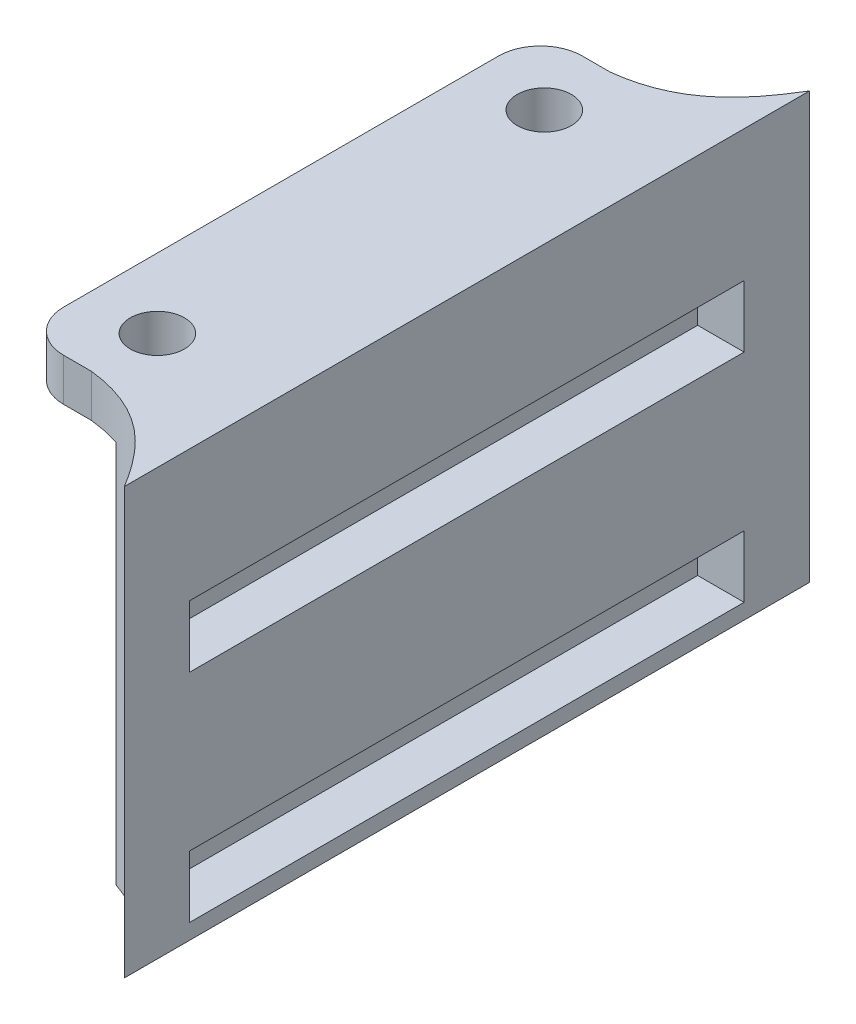
ISO-10303-21;
HEADER;
FILE_DESCRIPTION(('STEP AP214'),'2;1');
FILE_NAME('part.step','',(''),(''),'','','');
FILE_SCHEMA(('AUTOMOTIVE_DESIGN { 1 0 10303 214 1 1 1 1 }'));
ENDSEC;
DATA;
#1=APPLICATION_CONTEXT('core data for automotive mechanical design processes');
#2=APPLICATION_PROTOCOL_DEFINITION('international standard','automotive_design',2000,#1);
#3=PRODUCT_CONTEXT('',#1,'mechanical');
#4=PRODUCT('Part','Part','',(#3));
#5=PRODUCT_RELATED_PRODUCT_CATEGORY('part','',(#4));
#6=PRODUCT_DEFINITION_FORMATION('','',#4);
#7=PRODUCT_DEFINITION_CONTEXT('part definition',#1,'design');
#8=PRODUCT_DEFINITION('design','',#6,#7);
#9=PRODUCT_DEFINITION_SHAPE('','',#8);
#10=(LENGTH_UNIT() NAMED_UNIT(*) SI_UNIT(.MILLI.,.METRE.));
#11=(NAMED_UNIT(*) PLANE_ANGLE_UNIT() SI_UNIT($,.RADIAN.));
#12=(NAMED_UNIT(*) SI_UNIT($,.STERADIAN.) SOLID_ANGLE_UNIT());
#13=UNCERTAINTY_MEASURE_WITH_UNIT(LENGTH_MEASURE(1.E-05),#10,'distance_accuracy_value','');
#14=(GEOMETRIC_REPRESENTATION_CONTEXT(3) GLOBAL_UNCERTAINTY_ASSIGNED_CONTEXT((#13)) GLOBAL_UNIT_ASSIGNED_CONTEXT((#10,
#11,#12)) REPRESENTATION_CONTEXT('',''));
#15=CARTESIAN_POINT('',(0.,0.,0.));
#16=DIRECTION('',(0.,0.,1.));
#17=DIRECTION('',(1.,0.,0.));
#18=AXIS2_PLACEMENT_3D('',#15,#16,#17);
#19=CARTESIAN_POINT('',(-108.297393364929,-5.5,-30.1667131943031));
#20=DIRECTION('',(0.,1.,0.));
#21=DIRECTION('',(0.,0.,1.));
#22=AXIS2_PLACEMENT_3D('',#19,#20,#21);
#23=PLANE('',#22);
#24=CARTESIAN_POINT('',(-115.897393364929,-5.5,-23.6568720379147));
#25=DIRECTION('',(0.,1.,0.));
#26=DIRECTION('',(0.,0.,1.));
#27=AXIS2_PLACEMENT_3D('',#24,#25,#26);
#28=CIRCLE('',#27,5.4);
#29=CARTESIAN_POINT('',(-121.297393364929,-5.5,-23.6568720379147));
#30=VERTEX_POINT('',#29);
#31=CARTESIAN_POINT('',(-115.897393364929,-5.5,-29.0568720379147));
#32=VERTEX_POINT('',#31);
#33=EDGE_CURVE('E277',#30,#32,#28,.F.);
#34=ORIENTED_EDGE('',*,*,#33,.T.);
#35=DIRECTION('',(1.,0.,0.));
#36=VECTOR('',#35,1.);
#37=CARTESIAN_POINT('',(-115.797393364929,-5.5,-29.0568720379147));
#38=LINE('',#37,#36);
#39=CARTESIAN_POINT('',(-112.297393364929,-5.5,-29.0568720379147));
#40=VERTEX_POINT('',#39);
#41=EDGE_CURVE('E280',#32,#40,#38,.T.);
#42=ORIENTED_EDGE('',*,*,#41,.T.);
#43=CARTESIAN_POINT('',(-77.2973933649289,-5.5,-58.0568720379147));
#44=CARTESIAN_POINT('',(-97.4782956804952,-5.5,-56.5585431866768));
#45=CARTESIAN_POINT('',(-92.6699085338428,-5.5,-31.2993802591503));
#46=CARTESIAN_POINT('',(-112.297393364929,-5.5,-29.0568720379147));
#47=B_SPLINE_CURVE_WITH_KNOTS('',3,(#43,#44,#45,#46),.UNSPECIFIED.,.F.,.F.,(4,4),(0.,1.),.UNSPECIFIED.);
#48=CARTESIAN_POINT('',(-108.297393364929,-5.5,-29.9218737288001));
#49=VERTEX_POINT('',#48);
#50=EDGE_CURVE('E283',#40,#49,#47,.F.);
#51=ORIENTED_EDGE('',*,*,#50,.T.);
#52=DIRECTION('',(0.,0.,-1.));
#53=VECTOR('',#52,1.);
#54=CARTESIAN_POINT('',(-108.297393364929,-5.5,-30.1667131943031));
#55=LINE('',#54,#53);
#56=CARTESIAN_POINT('',(-108.297393364929,-5.5,38.8081296529707));
#57=VERTEX_POINT('',#56);
#58=EDGE_CURVE('E311',#57,#49,#55,.T.);
#59=ORIENTED_EDGE('',*,*,#58,.F.);
#60=CARTESIAN_POINT('',(-112.297393364929,-5.5,37.9431279620853));
#61=CARTESIAN_POINT('',(-92.6699085338428,-5.5,40.1856361833209));
#62=CARTESIAN_POINT('',(-97.4782956804952,-5.5,65.4447991108473));
#63=CARTESIAN_POINT('',(-77.2973933649289,-5.5,66.9431279620853));
#64=B_SPLINE_CURVE_WITH_KNOTS('',3,(#60,#61,#62,#63),.UNSPECIFIED.,.F.,.F.,(4,4),(0.,1.),.UNSPECIFIED.);
#65=CARTESIAN_POINT('',(-112.297393364929,-5.5,37.9431279620853));
#66=VERTEX_POINT('',#65);
#67=EDGE_CURVE('E294',#57,#66,#64,.F.);
#68=ORIENTED_EDGE('',*,*,#67,.T.);
#69=DIRECTION('',(-1.,0.,0.));
#70=VECTOR('',#69,1.);
#71=CARTESIAN_POINT('',(-115.797393364929,-5.5,37.9431279620853));
#72=LINE('',#71,#70);
#73=CARTESIAN_POINT('',(-115.897393364929,-5.5,37.9431279620853));
#74=VERTEX_POINT('',#73);
#75=EDGE_CURVE('E299',#66,#74,#72,.T.);
#76=ORIENTED_EDGE('',*,*,#75,.T.);
#77=CARTESIAN_POINT('',(-115.897393364929,-5.5,32.5431279620853));
#78=DIRECTION('',(0.,1.,0.));
#79=DIRECTION('',(0.,0.,1.));
#80=AXIS2_PLACEMENT_3D('',#77,#78,#79);
#81=CIRCLE('',#80,5.4);
#82=CARTESIAN_POINT('',(-121.297393364929,-5.5,32.5431279620853));
#83=VERTEX_POINT('',#82);
#84=EDGE_CURVE('E288',#74,#83,#81,.F.);
#85=ORIENTED_EDGE('',*,*,#84,.T.);
#86=DIRECTION('',(0.,0.,-1.));
#87=VECTOR('',#86,1.);
#88=CARTESIAN_POINT('',(-121.297393364929,-5.5,-30.1667131943031));
#89=LINE('',#88,#87);
#90=EDGE_CURVE('E239',#83,#30,#89,.T.);
#91=ORIENTED_EDGE('',*,*,#90,.T.);
#92=EDGE_LOOP('',(#34,#42,#51,#59,#68,#76,#85,#91));
#93=FACE_BOUND('',#92,.T.);
#94=CARTESIAN_POINT('',(-112.297393364929,-5.5,29.4431279620853));
#95=DIRECTION('',(0.,1.,0.));
#96=DIRECTION('',(0.,0.,1.));
#97=AXIS2_PLACEMENT_3D('',#94,#95,#96);
#98=CIRCLE('',#97,3.50000000000001);
#99=CARTESIAN_POINT('',(-112.297393364929,-5.5,32.9431279620853));
#100=VERTEX_POINT('',#99);
#101=EDGE_CURVE('E308',#100,#100,#98,.F.);
#102=ORIENTED_EDGE('',*,*,#101,.F.);
#103=EDGE_LOOP('',(#102));
#104=FACE_BOUND('',#103,.T.);
#105=CARTESIAN_POINT('',(-112.297393364929,-5.5,-20.5568720379147));
#106=DIRECTION('',(0.,1.,0.));
#107=DIRECTION('',(0.,0.,1.));
#108=AXIS2_PLACEMENT_3D('',#105,#106,#107);
#109=CIRCLE('',#108,3.50000000000001);
#110=CARTESIAN_POINT('',(-112.297393364929,-5.5,-17.0568720379147));
#111=VERTEX_POINT('',#110);
#112=EDGE_CURVE('E305',#111,#111,#109,.F.);
#113=ORIENTED_EDGE('',*,*,#112,.F.);
#114=EDGE_LOOP('',(#113));
#115=FACE_BOUND('',#114,.T.);
#116=ADVANCED_FACE('F35',(#93,#104,#115),#23,.F.);
#117=CARTESIAN_POINT('',(-108.297393364929,0.,0.));
#118=DIRECTION('',(-1.,0.,0.));
#119=DIRECTION('',(0.,0.,1.));
#120=AXIS2_PLACEMENT_3D('',#117,#118,#119);
#121=PLANE('',#120);
#122=DIRECTION('',(0.,0.,-1.));
#123=VECTOR('',#122,1.);
#124=CARTESIAN_POINT('',(-108.297393364929,-55.,32.5431279620853));
#125=LINE('',#124,#123);
#126=CARTESIAN_POINT('',(-108.297393364929,-55.,38.8081296548846));
#127=VERTEX_POINT('',#126);
#128=CARTESIAN_POINT('',(-108.297393359178,-55.,-29.921873730714));
#129=VERTEX_POINT('',#128);
#130=EDGE_CURVE('E419',#127,#129,#125,.T.);
#131=ORIENTED_EDGE('',*,*,#130,.F.);
#132=DIRECTION('',(0.,1.,0.));
#133=VECTOR('',#132,1.);
#134=CARTESIAN_POINT('',(-108.297393364929,-55.,38.8081296529707));
#135=LINE('',#134,#133);
#136=EDGE_CURVE('E252',#57,#127,#135,.F.);
#137=ORIENTED_EDGE('',*,*,#136,.F.);
#138=ORIENTED_EDGE('',*,*,#58,.T.);
#139=DIRECTION('',(0.,1.,0.));
#140=VECTOR('',#139,1.);
#141=CARTESIAN_POINT('',(-108.297393364929,-55.,-29.9218737288001));
#142=LINE('',#141,#140);
#143=EDGE_CURVE('E273',#129,#49,#142,.T.);
#144=ORIENTED_EDGE('',*,*,#143,.F.);
#145=EDGE_LOOP('',(#131,#137,#138,#144));
#146=FACE_BOUND('',#145,.T.);
#147=ADVANCED_FACE('F167',(#146),#121,.T.);
#148=CARTESIAN_POINT('',(-112.297393364929,-55.,-20.5568720379147));
#149=DIRECTION('',(0.,1.,0.));
#150=DIRECTION('',(0.,0.,1.));
#151=AXIS2_PLACEMENT_3D('',#148,#149,#150);
#152=CYLINDRICAL_SURFACE('',#151,3.50000000000001);
#153=ORIENTED_EDGE('',*,*,#112,.T.);
#154=EDGE_LOOP('',(#153));
#155=FACE_BOUND('',#154,.T.);
#156=CARTESIAN_POINT('',(-112.297393364929,0.,-20.5568720379147));
#157=DIRECTION('',(0.,1.,0.));
#158=DIRECTION('',(0.,0.,1.));
#159=AXIS2_PLACEMENT_3D('',#156,#157,#158);
#160=CIRCLE('',#159,3.50000000000001);
#161=CARTESIAN_POINT('',(-112.297393364929,0.,-17.0568720379147));
#162=VERTEX_POINT('',#161);
#163=EDGE_CURVE('E264',#162,#162,#160,.T.);
#164=ORIENTED_EDGE('',*,*,#163,.T.);
#165=EDGE_LOOP('',(#164));
#166=FACE_BOUND('',#165,.T.);
#167=ADVANCED_FACE('F163',(#155,#166),#152,.F.);
#168=CARTESIAN_POINT('',(-112.297393364929,-55.,29.4431279620853));
#169=DIRECTION('',(0.,1.,0.));
#170=DIRECTION('',(0.,0.,1.));
#171=AXIS2_PLACEMENT_3D('',#168,#169,#170);
#172=CYLINDRICAL_SURFACE('',#171,3.50000000000001);
#173=ORIENTED_EDGE('',*,*,#101,.T.);
#174=EDGE_LOOP('',(#173));
#175=FACE_BOUND('',#174,.T.);
#176=CARTESIAN_POINT('',(-112.297393364929,0.,29.4431279620853));
#177=DIRECTION('',(0.,1.,0.));
#178=DIRECTION('',(0.,0.,1.));
#179=AXIS2_PLACEMENT_3D('',#176,#177,#178);
#180=CIRCLE('',#179,3.50000000000001);
#181=CARTESIAN_POINT('',(-112.297393364929,0.,32.9431279620853));
#182=VERTEX_POINT('',#181);
#183=EDGE_CURVE('E270',#182,#182,#180,.T.);
#184=ORIENTED_EDGE('',*,*,#183,.T.);
#185=EDGE_LOOP('',(#184));
#186=FACE_BOUND('',#185,.T.);
#187=ADVANCED_FACE('F166',(#175,#186),#172,.F.);
#188=CARTESIAN_POINT('',(-115.797393364929,-55.,37.9431279620853));
#189=DIRECTION('',(0.,0.,1.));
#190=DIRECTION('',(1.,0.,0.));
#191=AXIS2_PLACEMENT_3D('',#188,#189,#190);
#192=PLANE('',#191);
#193=ORIENTED_EDGE('',*,*,#75,.F.);
#194=DIRECTION('',(0.,1.,0.));
#195=VECTOR('',#194,1.);
#196=CARTESIAN_POINT('',(-112.297393364929,-55.,37.9431279620853));
#197=LINE('',#196,#195);
#198=CARTESIAN_POINT('',(-112.297393364929,0.,37.9431279620853));
#199=VERTEX_POINT('',#198);
#200=EDGE_CURVE('E450',#66,#199,#197,.T.);
#201=ORIENTED_EDGE('',*,*,#200,.T.);
#202=DIRECTION('',(1.,0.,0.));
#203=VECTOR('',#202,1.);
#204=CARTESIAN_POINT('',(-115.797393364929,0.,37.9431279620853));
#205=LINE('',#204,#203);
#206=CARTESIAN_POINT('',(-115.897393364929,0.,37.9431279620853));
#207=VERTEX_POINT('',#206);
#208=EDGE_CURVE('E434',#207,#199,#205,.T.);
#209=ORIENTED_EDGE('',*,*,#208,.F.);
#210=DIRECTION('',(0.,1.,0.));
#211=VECTOR('',#210,1.);
#212=CARTESIAN_POINT('',(-115.897393364929,-55.,37.9431279620853));
#213=LINE('',#212,#211);
#214=EDGE_CURVE('E134',#74,#207,#213,.T.);
#215=ORIENTED_EDGE('',*,*,#214,.F.);
#216=EDGE_LOOP('',(#193,#201,#209,#215));
#217=FACE_BOUND('',#216,.T.);
#218=ADVANCED_FACE('F171',(#217),#192,.T.);
#219=CARTESIAN_POINT('',(-115.897393364929,-55.,32.5431279620853));
#220=DIRECTION('',(0.,1.,0.));
#221=DIRECTION('',(0.,0.,1.));
#222=AXIS2_PLACEMENT_3D('',#219,#220,#221);
#223=CYLINDRICAL_SURFACE('',#222,5.4);
#224=ORIENTED_EDGE('',*,*,#84,.F.);
#225=ORIENTED_EDGE('',*,*,#214,.T.);
#226=CARTESIAN_POINT('',(-115.897393364929,0.,32.5431279620853));
#227=DIRECTION('',(0.,1.,0.));
#228=DIRECTION('',(0.,0.,-1.));
#229=AXIS2_PLACEMENT_3D('',#226,#227,#228);
#230=CIRCLE('',#229,5.4);
#231=CARTESIAN_POINT('',(-121.297393364929,0.,32.5431279620853));
#232=VERTEX_POINT('',#231);
#233=EDGE_CURVE('E262',#232,#207,#230,.T.);
#234=ORIENTED_EDGE('',*,*,#233,.F.);
#235=DIRECTION('',(0.,1.,0.));
#236=VECTOR('',#235,1.);
#237=CARTESIAN_POINT('',(-121.297393364929,-55.,32.5431279620853));
#238=LINE('',#237,#236);
#239=EDGE_CURVE('E415',#83,#232,#238,.T.);
#240=ORIENTED_EDGE('',*,*,#239,.F.);
#241=EDGE_LOOP('',(#224,#225,#234,#240));
#242=FACE_BOUND('',#241,.T.);
#243=ADVANCED_FACE('F161',(#242),#223,.T.);
#244=CARTESIAN_POINT('',(-121.297393364929,-55.,-23.6568720379147));
#245=DIRECTION('',(-1.,0.,0.));
#246=DIRECTION('',(0.,0.,1.));
#247=AXIS2_PLACEMENT_3D('',#244,#245,#246);
#248=PLANE('',#247);
#249=ORIENTED_EDGE('',*,*,#90,.F.);
#250=ORIENTED_EDGE('',*,*,#239,.T.);
#251=DIRECTION('',(0.,0.,1.));
#252=VECTOR('',#251,1.);
#253=CARTESIAN_POINT('',(-121.297393364929,0.,-23.6568720379147));
#254=LINE('',#253,#252);
#255=CARTESIAN_POINT('',(-121.297393364929,0.,-23.6568720379147));
#256=VERTEX_POINT('',#255);
#257=EDGE_CURVE('E253',#256,#232,#254,.T.);
#258=ORIENTED_EDGE('',*,*,#257,.F.);
#259=DIRECTION('',(0.,1.,0.));
#260=VECTOR('',#259,1.);
#261=CARTESIAN_POINT('',(-121.297393364929,-55.,-23.6568720379147));
#262=LINE('',#261,#260);
#263=EDGE_CURVE('E417',#30,#256,#262,.T.);
#264=ORIENTED_EDGE('',*,*,#263,.F.);
#265=EDGE_LOOP('',(#249,#250,#258,#264));
#266=FACE_BOUND('',#265,.T.);
#267=ADVANCED_FACE('F157',(#266),#248,.T.);
#268=CARTESIAN_POINT('',(-115.897393364929,-55.,-23.6568720379147));
#269=DIRECTION('',(0.,1.,0.));
#270=DIRECTION('',(0.,0.,1.));
#271=AXIS2_PLACEMENT_3D('',#268,#269,#270);
#272=CYLINDRICAL_SURFACE('',#271,5.4);
#273=ORIENTED_EDGE('',*,*,#33,.F.);
#274=ORIENTED_EDGE('',*,*,#263,.T.);
#275=CARTESIAN_POINT('',(-115.897393364929,0.,-23.6568720379147));
#276=DIRECTION('',(0.,1.,0.));
#277=DIRECTION('',(0.,0.,1.));
#278=AXIS2_PLACEMENT_3D('',#275,#276,#277);
#279=CIRCLE('',#278,5.4);
#280=CARTESIAN_POINT('',(-115.897393364929,0.,-29.0568720379147));
#281=VERTEX_POINT('',#280);
#282=EDGE_CURVE('E255',#281,#256,#279,.T.);
#283=ORIENTED_EDGE('',*,*,#282,.F.);
#284=DIRECTION('',(0.,1.,0.));
#285=VECTOR('',#284,1.);
#286=CARTESIAN_POINT('',(-115.897393364929,-55.,-29.0568720379147));
#287=LINE('',#286,#285);
#288=EDGE_CURVE('E421',#32,#281,#287,.T.);
#289=ORIENTED_EDGE('',*,*,#288,.F.);
#290=EDGE_LOOP('',(#273,#274,#283,#289));
#291=FACE_BOUND('',#290,.T.);
#292=ADVANCED_FACE('F153',(#291),#272,.T.);
#293=CARTESIAN_POINT('',(-115.797393364929,-55.,-29.0568720379147));
#294=DIRECTION('',(0.,0.,-1.));
#295=DIRECTION('',(-1.,0.,0.));
#296=AXIS2_PLACEMENT_3D('',#293,#294,#295);
#297=PLANE('',#296);
#298=ORIENTED_EDGE('',*,*,#41,.F.);
#299=ORIENTED_EDGE('',*,*,#288,.T.);
#300=DIRECTION('',(-1.,0.,0.));
#301=VECTOR('',#300,1.);
#302=CARTESIAN_POINT('',(-115.797393364929,0.,-29.0568720379147));
#303=LINE('',#302,#301);
#304=CARTESIAN_POINT('',(-112.297393364929,0.,-29.0568720379147));
#305=VERTEX_POINT('',#304);
#306=EDGE_CURVE('E428',#305,#281,#303,.T.);
#307=ORIENTED_EDGE('',*,*,#306,.F.);
#308=DIRECTION('',(0.,1.,0.));
#309=VECTOR('',#308,1.);
#310=CARTESIAN_POINT('',(-112.297393364929,-55.,-29.0568720379147));
#311=LINE('',#310,#309);
#312=EDGE_CURVE('E448',#40,#305,#311,.T.);
#313=ORIENTED_EDGE('',*,*,#312,.F.);
#314=EDGE_LOOP('',(#298,#299,#307,#313));
#315=FACE_BOUND('',#314,.T.);
#316=ADVANCED_FACE('F147',(#315),#297,.T.);
#317=CARTESIAN_POINT('',(-77.2973933649289,-55.,-58.0568720379147));
#318=CARTESIAN_POINT('',(-97.4782956804952,-55.,-56.5585431866768));
#319=CARTESIAN_POINT('',(-92.6699085338428,-55.,-31.2993802591503));
#320=CARTESIAN_POINT('',(-112.297393364929,-55.,-29.0568720379147));
#321=B_SPLINE_CURVE_WITH_KNOTS('',3,(#317,#318,#319,#320),.UNSPECIFIED.,.F.,.F.,(4,4),(0.,1.),.UNSPECIFIED.);
#322=DIRECTION('',(0.,1.,0.));
#323=VECTOR('',#322,1.);
#324=SURFACE_OF_LINEAR_EXTRUSION('',#321,#323);
#325=DIRECTION('',(0.,1.,0.));
#326=VECTOR('',#325,1.);
#327=CARTESIAN_POINT('',(-97.2973933577945,-55.,-39.823610008286));
#328=LINE('',#327,#326);
#329=CARTESIAN_POINT('',(-97.2973933577945,-55.,-39.823610008286));
#330=VERTEX_POINT('',#329);
#331=CARTESIAN_POINT('',(-97.2973933480429,0.,-39.8236100243836));
#332=VERTEX_POINT('',#331);
#333=EDGE_CURVE('E248',#330,#332,#328,.T.);
#334=ORIENTED_EDGE('',*,*,#333,.F.);
#335=EDGE_CURVE('E127',#330,#129,#321,.T.);
#336=ORIENTED_EDGE('',*,*,#335,.T.);
#337=ORIENTED_EDGE('',*,*,#143,.T.);
#338=ORIENTED_EDGE('',*,*,#50,.F.);
#339=ORIENTED_EDGE('',*,*,#312,.T.);
#340=CARTESIAN_POINT('',(-77.2973933649289,0.,-58.0568720379147));
#341=CARTESIAN_POINT('',(-97.4782956804952,0.,-56.5585431866768));
#342=CARTESIAN_POINT('',(-92.6699085338428,0.,-31.2993802591503));
#343=CARTESIAN_POINT('',(-112.297393364929,0.,-29.0568720379147));
#344=B_SPLINE_CURVE_WITH_KNOTS('',3,(#340,#341,#342,#343),.UNSPECIFIED.,.F.,.F.,(4,4),(0.,1.),.UNSPECIFIED.);
#345=EDGE_CURVE('E135',#332,#305,#344,.T.);
#346=ORIENTED_EDGE('',*,*,#345,.F.);
#347=EDGE_LOOP('',(#334,#336,#337,#338,#339,#346));
#348=FACE_BOUND('',#347,.T.);
#349=ADVANCED_FACE('F142',(#348),#324,.T.);
#350=CARTESIAN_POINT('',(-112.297393364929,-55.,37.9431279620853));
#351=CARTESIAN_POINT('',(-92.6699085338428,-55.,40.1856361833209));
#352=CARTESIAN_POINT('',(-97.4782956804952,-55.,65.4447991108473));
#353=CARTESIAN_POINT('',(-77.2973933649289,-55.,66.9431279620853));
#354=B_SPLINE_CURVE_WITH_KNOTS('',3,(#350,#351,#352,#353),.UNSPECIFIED.,.F.,.F.,(4,4),(0.,1.),.UNSPECIFIED.);
#355=DIRECTION('',(0.,1.,0.));
#356=VECTOR('',#355,1.);
#357=SURFACE_OF_LINEAR_EXTRUSION('',#354,#356);
#358=DIRECTION('',(0.,1.,0.));
#359=VECTOR('',#358,1.);
#360=CARTESIAN_POINT('',(-97.2973933577952,-55.,48.7098659324555));
#361=LINE('',#360,#359);
#362=CARTESIAN_POINT('',(-97.2973933480436,0.,48.7098659485531));
#363=VERTEX_POINT('',#362);
#364=CARTESIAN_POINT('',(-97.2973933577952,-55.,48.7098659324555));
#365=VERTEX_POINT('',#364);
#366=EDGE_CURVE('E39',#363,#365,#361,.F.);
#367=ORIENTED_EDGE('',*,*,#366,.F.);
#368=CARTESIAN_POINT('',(-112.297393364929,0.,37.9431279620853));
#369=CARTESIAN_POINT('',(-92.6699085338428,0.,40.1856361833209));
#370=CARTESIAN_POINT('',(-97.4782956804952,0.,65.4447991108473));
#371=CARTESIAN_POINT('',(-77.2973933649289,0.,66.9431279620853));
#372=B_SPLINE_CURVE_WITH_KNOTS('',3,(#368,#369,#370,#371),.UNSPECIFIED.,.F.,.F.,(4,4),(0.,1.),.UNSPECIFIED.);
#373=EDGE_CURVE('E431',#199,#363,#372,.T.);
#374=ORIENTED_EDGE('',*,*,#373,.F.);
#375=ORIENTED_EDGE('',*,*,#200,.F.);
#376=ORIENTED_EDGE('',*,*,#67,.F.);
#377=ORIENTED_EDGE('',*,*,#136,.T.);
#378=EDGE_CURVE('E133',#127,#365,#354,.T.);
#379=ORIENTED_EDGE('',*,*,#378,.T.);
#380=EDGE_LOOP('',(#367,#374,#375,#376,#377,#379));
#381=FACE_BOUND('',#380,.T.);
#382=ADVANCED_FACE('F146',(#381),#357,.T.);
#383=CARTESIAN_POINT('',(-115.897393364929,0.,32.5431279620853));
#384=DIRECTION('',(0.,-1.,0.));
#385=DIRECTION('',(0.,0.,-1.));
#386=AXIS2_PLACEMENT_3D('',#383,#384,#385);
#387=PLANE('',#386);
#388=ORIENTED_EDGE('',*,*,#373,.T.);
#389=DIRECTION('',(0.,0.,1.));
#390=VECTOR('',#389,1.);
#391=CARTESIAN_POINT('',(-97.2973933649289,0.,-31.3723575276166));
#392=LINE('',#391,#390);
#393=EDGE_CURVE('E238',#332,#363,#392,.T.);
#394=ORIENTED_EDGE('',*,*,#393,.F.);
#395=ORIENTED_EDGE('',*,*,#345,.T.);
#396=ORIENTED_EDGE('',*,*,#306,.T.);
#397=ORIENTED_EDGE('',*,*,#282,.T.);
#398=ORIENTED_EDGE('',*,*,#257,.T.);
#399=ORIENTED_EDGE('',*,*,#233,.T.);
#400=ORIENTED_EDGE('',*,*,#208,.T.);
#401=EDGE_LOOP('',(#388,#394,#395,#396,#397,#398,#399,#400));
#402=FACE_BOUND('',#401,.T.);
#403=ORIENTED_EDGE('',*,*,#183,.F.);
#404=EDGE_LOOP('',(#403));
#405=FACE_BOUND('',#404,.T.);
#406=ORIENTED_EDGE('',*,*,#163,.F.);
#407=EDGE_LOOP('',(#406));
#408=FACE_BOUND('',#407,.T.);
#409=ADVANCED_FACE('F37',(#402,#405,#408),#387,.F.);
#410=CARTESIAN_POINT('',(-115.897393364929,-55.,32.5431279620853));
#411=DIRECTION('',(0.,-1.,0.));
#412=DIRECTION('',(0.,0.,-1.));
#413=AXIS2_PLACEMENT_3D('',#410,#411,#412);
#414=PLANE('',#413);
#415=DIRECTION('',(0.,0.,1.));
#416=VECTOR('',#415,1.);
#417=CARTESIAN_POINT('',(-97.2973933649289,-55.,-31.3723575276166));
#418=LINE('',#417,#416);
#419=EDGE_CURVE('E228',#330,#365,#418,.T.);
#420=ORIENTED_EDGE('',*,*,#419,.T.);
#421=ORIENTED_EDGE('',*,*,#378,.F.);
#422=ORIENTED_EDGE('',*,*,#130,.T.);
#423=ORIENTED_EDGE('',*,*,#335,.F.);
#424=EDGE_LOOP('',(#420,#421,#422,#423));
#425=FACE_BOUND('',#424,.T.);
#426=ADVANCED_FACE('F198',(#425),#414,.T.);
#427=CARTESIAN_POINT('',(-97.2973933577945,-55.02,-39.823610008286));
#428=DIRECTION('',(-1.,0.,0.));
#429=DIRECTION('',(0.,0.,1.));
#430=AXIS2_PLACEMENT_3D('',#427,#428,#429);
#431=PLANE('',#430);
#432=DIRECTION('',(0.,1.,0.));
#433=VECTOR('',#432,1.);
#434=CARTESIAN_POINT('',(-97.2973933649289,-45.,-31.3723575276166));
#435=LINE('',#434,#433);
#436=CARTESIAN_POINT('',(-97.2973933649289,-53.,-31.3723575276166));
#437=VERTEX_POINT('',#436);
#438=CARTESIAN_POINT('',(-97.2973933649289,-45.,-31.3723575276166));
#439=VERTEX_POINT('',#438);
#440=EDGE_CURVE('E123',#437,#439,#435,.T.);
#441=ORIENTED_EDGE('',*,*,#440,.F.);
#442=DIRECTION('',(0.,0.,-1.));
#443=VECTOR('',#442,1.);
#444=CARTESIAN_POINT('',(-97.2973933649289,-53.,40.2586431743358));
#445=LINE('',#444,#443);
#446=CARTESIAN_POINT('',(-97.2973933649289,-53.,40.2586431743358));
#447=VERTEX_POINT('',#446);
#448=EDGE_CURVE('E355',#447,#437,#445,.T.);
#449=ORIENTED_EDGE('',*,*,#448,.F.);
#450=DIRECTION('',(0.,-1.,0.));
#451=VECTOR('',#450,1.);
#452=CARTESIAN_POINT('',(-97.2973933649289,-45.,40.2586431743358));
#453=LINE('',#452,#451);
#454=CARTESIAN_POINT('',(-97.2973933649289,-45.,40.2586431743358));
#455=VERTEX_POINT('',#454);
#456=EDGE_CURVE('E107',#455,#447,#453,.T.);
#457=ORIENTED_EDGE('',*,*,#456,.F.);
#458=DIRECTION('',(0.,0.,1.));
#459=VECTOR('',#458,1.);
#460=CARTESIAN_POINT('',(-97.2973933649289,-45.,40.2586431743358));
#461=LINE('',#460,#459);
#462=EDGE_CURVE('E120',#439,#455,#461,.T.);
#463=ORIENTED_EDGE('',*,*,#462,.F.);
#464=EDGE_LOOP('',(#441,#449,#457,#463));
#465=FACE_BOUND('',#464,.T.);
#466=DIRECTION('',(0.,1.,0.));
#467=VECTOR('',#466,1.);
#468=CARTESIAN_POINT('',(-97.2973933649289,-25.,-31.3723575276166));
#469=LINE('',#468,#467);
#470=CARTESIAN_POINT('',(-97.2973933649289,-25.,-31.3723575276166));
#471=VERTEX_POINT('',#470);
#472=CARTESIAN_POINT('',(-97.2973933649289,-17.,-31.3723575276166));
#473=VERTEX_POINT('',#472);
#474=EDGE_CURVE('E54',#471,#473,#469,.T.);
#475=ORIENTED_EDGE('',*,*,#474,.F.);
#476=DIRECTION('',(0.,0.,-1.));
#477=VECTOR('',#476,1.);
#478=CARTESIAN_POINT('',(-97.2973933649289,-25.,40.2586431743358));
#479=LINE('',#478,#477);
#480=CARTESIAN_POINT('',(-97.2973933649289,-25.,40.2586431743358));
#481=VERTEX_POINT('',#480);
#482=EDGE_CURVE('E45',#481,#471,#479,.T.);
#483=ORIENTED_EDGE('',*,*,#482,.F.);
#484=DIRECTION('',(0.,-1.,0.));
#485=VECTOR('',#484,1.);
#486=CARTESIAN_POINT('',(-97.2973933649289,-17.,40.2586431743358));
#487=LINE('',#486,#485);
#488=CARTESIAN_POINT('',(-97.2973933649289,-17.,40.2586431743358));
#489=VERTEX_POINT('',#488);
#490=EDGE_CURVE('E11',#489,#481,#487,.T.);
#491=ORIENTED_EDGE('',*,*,#490,.F.);
#492=DIRECTION('',(0.,0.,1.));
#493=VECTOR('',#492,1.);
#494=CARTESIAN_POINT('',(-97.2973933649289,-17.,40.2586431743358));
#495=LINE('',#494,#493);
#496=EDGE_CURVE('E332',#473,#489,#495,.T.);
#497=ORIENTED_EDGE('',*,*,#496,.F.);
#498=EDGE_LOOP('',(#475,#483,#491,#497));
#499=FACE_BOUND('',#498,.T.);
#500=ORIENTED_EDGE('',*,*,#419,.F.);
#501=ORIENTED_EDGE('',*,*,#333,.T.);
#502=ORIENTED_EDGE('',*,*,#393,.T.);
#503=ORIENTED_EDGE('',*,*,#366,.T.);
#504=EDGE_LOOP('',(#500,#501,#502,#503));
#505=FACE_BOUND('',#504,.T.);
#506=ADVANCED_FACE('F176',(#465,#499,#505),#431,.F.);
#507=CARTESIAN_POINT('',(-103.297393364929,-17.,40.2586431743358));
#508=DIRECTION('',(0.,1.,0.));
#509=DIRECTION('',(0.,0.,1.));
#510=AXIS2_PLACEMENT_3D('',#507,#508,#509);
#511=PLANE('',#510);
#512=ORIENTED_EDGE('',*,*,#496,.T.);
#513=DIRECTION('',(1.,0.,0.));
#514=VECTOR('',#513,1.);
#515=CARTESIAN_POINT('',(-103.297393364929,-17.,40.2586431743358));
#516=LINE('',#515,#514);
#517=CARTESIAN_POINT('',(-103.297393364929,-17.,40.2586431743358));
#518=VERTEX_POINT('',#517);
#519=EDGE_CURVE('E329',#518,#489,#516,.T.);
#520=ORIENTED_EDGE('',*,*,#519,.F.);
#521=DIRECTION('',(0.,0.,1.));
#522=VECTOR('',#521,1.);
#523=CARTESIAN_POINT('',(-103.297393364929,-17.,40.2586431743358));
#524=LINE('',#523,#522);
#525=CARTESIAN_POINT('',(-103.297393364929,-17.,-31.3723575276166));
#526=VERTEX_POINT('',#525);
#527=EDGE_CURVE('E323',#526,#518,#524,.T.);
#528=ORIENTED_EDGE('',*,*,#527,.F.);
#529=DIRECTION('',(1.,0.,0.));
#530=VECTOR('',#529,1.);
#531=CARTESIAN_POINT('',(-103.297393364929,-17.,-31.3723575276166));
#532=LINE('',#531,#530);
#533=EDGE_CURVE('E326',#526,#473,#532,.T.);
#534=ORIENTED_EDGE('',*,*,#533,.T.);
#535=EDGE_LOOP('',(#512,#520,#528,#534));
#536=FACE_BOUND('',#535,.T.);
#537=ADVANCED_FACE('F184',(#536),#511,.F.);
#538=CARTESIAN_POINT('',(-103.297393364929,-17.,40.2586431743358));
#539=DIRECTION('',(0.,0.,1.));
#540=DIRECTION('',(1.,0.,0.));
#541=AXIS2_PLACEMENT_3D('',#538,#539,#540);
#542=PLANE('',#541);
#543=ORIENTED_EDGE('',*,*,#490,.T.);
#544=DIRECTION('',(1.,0.,0.));
#545=VECTOR('',#544,1.);
#546=CARTESIAN_POINT('',(-103.297393364929,-25.,40.2586431743358));
#547=LINE('',#546,#545);
#548=CARTESIAN_POINT('',(-103.297393364929,-25.,40.2586431743358));
#549=VERTEX_POINT('',#548);
#550=EDGE_CURVE('E320',#549,#481,#547,.T.);
#551=ORIENTED_EDGE('',*,*,#550,.F.);
#552=DIRECTION('',(0.,-1.,0.));
#553=VECTOR('',#552,1.);
#554=CARTESIAN_POINT('',(-103.297393364929,-17.,40.2586431743358));
#555=LINE('',#554,#553);
#556=EDGE_CURVE('E335',#518,#549,#555,.T.);
#557=ORIENTED_EDGE('',*,*,#556,.F.);
#558=ORIENTED_EDGE('',*,*,#519,.T.);
#559=EDGE_LOOP('',(#543,#551,#557,#558));
#560=FACE_BOUND('',#559,.T.);
#561=ADVANCED_FACE('F180',(#560),#542,.F.);
#562=CARTESIAN_POINT('',(-103.297393364929,0.,0.));
#563=DIRECTION('',(1.,0.,0.));
#564=DIRECTION('',(0.,0.,-1.));
#565=AXIS2_PLACEMENT_3D('',#562,#563,#564);
#566=PLANE('',#565);
#567=ORIENTED_EDGE('',*,*,#556,.T.);
#568=DIRECTION('',(0.,0.,-1.));
#569=VECTOR('',#568,1.);
#570=CARTESIAN_POINT('',(-103.297393364929,-25.,40.2586431743358));
#571=LINE('',#570,#569);
#572=CARTESIAN_POINT('',(-103.297393364929,-25.,-31.3723575276166));
#573=VERTEX_POINT('',#572);
#574=EDGE_CURVE('E344',#549,#573,#571,.T.);
#575=ORIENTED_EDGE('',*,*,#574,.T.);
#576=DIRECTION('',(0.,1.,0.));
#577=VECTOR('',#576,1.);
#578=CARTESIAN_POINT('',(-103.297393364929,-25.,-31.3723575276166));
#579=LINE('',#578,#577);
#580=EDGE_CURVE('E341',#573,#526,#579,.T.);
#581=ORIENTED_EDGE('',*,*,#580,.T.);
#582=ORIENTED_EDGE('',*,*,#527,.T.);
#583=EDGE_LOOP('',(#567,#575,#581,#582));
#584=FACE_BOUND('',#583,.T.);
#585=ADVANCED_FACE('F183',(#584),#566,.T.);
#586=CARTESIAN_POINT('',(-103.297393364929,-25.,-31.3723575276166));
#587=DIRECTION('',(0.,0.,-1.));
#588=DIRECTION('',(-1.,0.,0.));
#589=AXIS2_PLACEMENT_3D('',#586,#587,#588);
#590=PLANE('',#589);
#591=ORIENTED_EDGE('',*,*,#474,.T.);
#592=ORIENTED_EDGE('',*,*,#533,.F.);
#593=ORIENTED_EDGE('',*,*,#580,.F.);
#594=DIRECTION('',(1.,0.,0.));
#595=VECTOR('',#594,1.);
#596=CARTESIAN_POINT('',(-103.297393364929,-25.,-31.3723575276166));
#597=LINE('',#596,#595);
#598=EDGE_CURVE('E324',#573,#471,#597,.T.);
#599=ORIENTED_EDGE('',*,*,#598,.T.);
#600=EDGE_LOOP('',(#591,#592,#593,#599));
#601=FACE_BOUND('',#600,.T.);
#602=ADVANCED_FACE('F190',(#601),#590,.F.);
#603=CARTESIAN_POINT('',(-103.297393364929,-25.,40.2586431743358));
#604=DIRECTION('',(0.,-1.,0.));
#605=DIRECTION('',(0.,0.,-1.));
#606=AXIS2_PLACEMENT_3D('',#603,#604,#605);
#607=PLANE('',#606);
#608=ORIENTED_EDGE('',*,*,#482,.T.);
#609=ORIENTED_EDGE('',*,*,#598,.F.);
#610=ORIENTED_EDGE('',*,*,#574,.F.);
#611=ORIENTED_EDGE('',*,*,#550,.T.);
#612=EDGE_LOOP('',(#608,#609,#610,#611));
#613=FACE_BOUND('',#612,.T.);
#614=ADVANCED_FACE('F186',(#613),#607,.F.);
#615=CARTESIAN_POINT('',(-103.297393364929,-45.,40.2586431743358));
#616=DIRECTION('',(0.,1.,0.));
#617=DIRECTION('',(0.,0.,1.));
#618=AXIS2_PLACEMENT_3D('',#615,#616,#617);
#619=PLANE('',#618);
#620=ORIENTED_EDGE('',*,*,#462,.T.);
#621=DIRECTION('',(1.,0.,0.));
#622=VECTOR('',#621,1.);
#623=CARTESIAN_POINT('',(-103.297393364929,-45.,40.2586431743358));
#624=LINE('',#623,#622);
#625=CARTESIAN_POINT('',(-103.297393364929,-45.,40.2586431743358));
#626=VERTEX_POINT('',#625);
#627=EDGE_CURVE('E317',#626,#455,#624,.T.);
#628=ORIENTED_EDGE('',*,*,#627,.F.);
#629=DIRECTION('',(0.,0.,1.));
#630=VECTOR('',#629,1.);
#631=CARTESIAN_POINT('',(-103.297393364929,-45.,40.2586431743358));
#632=LINE('',#631,#630);
#633=CARTESIAN_POINT('',(-103.297393364929,-45.,-31.3723575276166));
#634=VERTEX_POINT('',#633);
#635=EDGE_CURVE('E109',#634,#626,#632,.T.);
#636=ORIENTED_EDGE('',*,*,#635,.F.);
#637=DIRECTION('',(1.,0.,0.));
#638=VECTOR('',#637,1.);
#639=CARTESIAN_POINT('',(-103.297393364929,-45.,-31.3723575276166));
#640=LINE('',#639,#638);
#641=EDGE_CURVE('E350',#634,#439,#640,.T.);
#642=ORIENTED_EDGE('',*,*,#641,.T.);
#643=EDGE_LOOP('',(#620,#628,#636,#642));
#644=FACE_BOUND('',#643,.T.);
#645=ADVANCED_FACE('F189',(#644),#619,.F.);
#646=CARTESIAN_POINT('',(-103.297393364929,-45.,40.2586431743358));
#647=DIRECTION('',(0.,0.,1.));
#648=DIRECTION('',(1.,0.,0.));
#649=AXIS2_PLACEMENT_3D('',#646,#647,#648);
#650=PLANE('',#649);
#651=ORIENTED_EDGE('',*,*,#456,.T.);
#652=DIRECTION('',(1.,0.,0.));
#653=VECTOR('',#652,1.);
#654=CARTESIAN_POINT('',(-103.297393364929,-53.,40.2586431743358));
#655=LINE('',#654,#653);
#656=CARTESIAN_POINT('',(-103.297393364929,-53.,40.2586431743358));
#657=VERTEX_POINT('',#656);
#658=EDGE_CURVE('E100',#657,#447,#655,.T.);
#659=ORIENTED_EDGE('',*,*,#658,.F.);
#660=DIRECTION('',(0.,-1.,0.));
#661=VECTOR('',#660,1.);
#662=CARTESIAN_POINT('',(-103.297393364929,-45.,40.2586431743358));
#663=LINE('',#662,#661);
#664=EDGE_CURVE('E104',#626,#657,#663,.T.);
#665=ORIENTED_EDGE('',*,*,#664,.F.);
#666=ORIENTED_EDGE('',*,*,#627,.T.);
#667=EDGE_LOOP('',(#651,#659,#665,#666));
#668=FACE_BOUND('',#667,.T.);
#669=ADVANCED_FACE('F101',(#668),#650,.F.);
#670=CARTESIAN_POINT('',(-103.297393364929,0.,0.));
#671=DIRECTION('',(1.,0.,0.));
#672=DIRECTION('',(0.,0.,-1.));
#673=AXIS2_PLACEMENT_3D('',#670,#671,#672);
#674=PLANE('',#673);
#675=ORIENTED_EDGE('',*,*,#664,.T.);
#676=DIRECTION('',(0.,0.,-1.));
#677=VECTOR('',#676,1.);
#678=CARTESIAN_POINT('',(-103.297393364929,-53.,40.2586431743358));
#679=LINE('',#678,#677);
#680=CARTESIAN_POINT('',(-103.297393364929,-53.,-31.3723575276166));
#681=VERTEX_POINT('',#680);
#682=EDGE_CURVE('E112',#657,#681,#679,.T.);
#683=ORIENTED_EDGE('',*,*,#682,.T.);
#684=DIRECTION('',(0.,1.,0.));
#685=VECTOR('',#684,1.);
#686=CARTESIAN_POINT('',(-103.297393364929,-45.,-31.3723575276166));
#687=LINE('',#686,#685);
#688=EDGE_CURVE('E116',#681,#634,#687,.T.);
#689=ORIENTED_EDGE('',*,*,#688,.T.);
#690=ORIENTED_EDGE('',*,*,#635,.T.);
#691=EDGE_LOOP('',(#675,#683,#689,#690));
#692=FACE_BOUND('',#691,.T.);
#693=ADVANCED_FACE('F118',(#692),#674,.T.);
#694=CARTESIAN_POINT('',(-103.297393364929,-45.,-31.3723575276166));
#695=DIRECTION('',(0.,0.,-1.));
#696=DIRECTION('',(-1.,0.,0.));
#697=AXIS2_PLACEMENT_3D('',#694,#695,#696);
#698=PLANE('',#697);
#699=ORIENTED_EDGE('',*,*,#440,.T.);
#700=ORIENTED_EDGE('',*,*,#641,.F.);
#701=ORIENTED_EDGE('',*,*,#688,.F.);
#702=DIRECTION('',(1.,0.,0.));
#703=VECTOR('',#702,1.);
#704=CARTESIAN_POINT('',(-103.297393364929,-53.,-31.3723575276166));
#705=LINE('',#704,#703);
#706=EDGE_CURVE('E93',#681,#437,#705,.T.);
#707=ORIENTED_EDGE('',*,*,#706,.T.);
#708=EDGE_LOOP('',(#699,#700,#701,#707));
#709=FACE_BOUND('',#708,.T.);
#710=ADVANCED_FACE('F206',(#709),#698,.F.);
#711=CARTESIAN_POINT('',(-103.297393364929,-53.,40.2586431743358));
#712=DIRECTION('',(0.,-1.,0.));
#713=DIRECTION('',(0.,0.,-1.));
#714=AXIS2_PLACEMENT_3D('',#711,#712,#713);
#715=PLANE('',#714);
#716=ORIENTED_EDGE('',*,*,#448,.T.);
#717=ORIENTED_EDGE('',*,*,#706,.F.);
#718=ORIENTED_EDGE('',*,*,#682,.F.);
#719=ORIENTED_EDGE('',*,*,#658,.T.);
#720=EDGE_LOOP('',(#716,#717,#718,#719));
#721=FACE_BOUND('',#720,.T.);
#722=ADVANCED_FACE('F113',(#721),#715,.F.);
#723=CLOSED_SHELL('',(#116,#147,#167,#187,#218,#243,#267,#292,#316,#349,#382,#409,#426,#506,
#537,#561,#585,#602,#614,#645,#669,#693,#710,#722));
#724=MANIFOLD_SOLID_BREP('B2',#723);
#725=ADVANCED_BREP_SHAPE_REPRESENTATION('',(#18,#724),#14);
#726=SHAPE_DEFINITION_REPRESENTATION(#9,#725);
ENDSEC;
END-ISO-10303-21;
